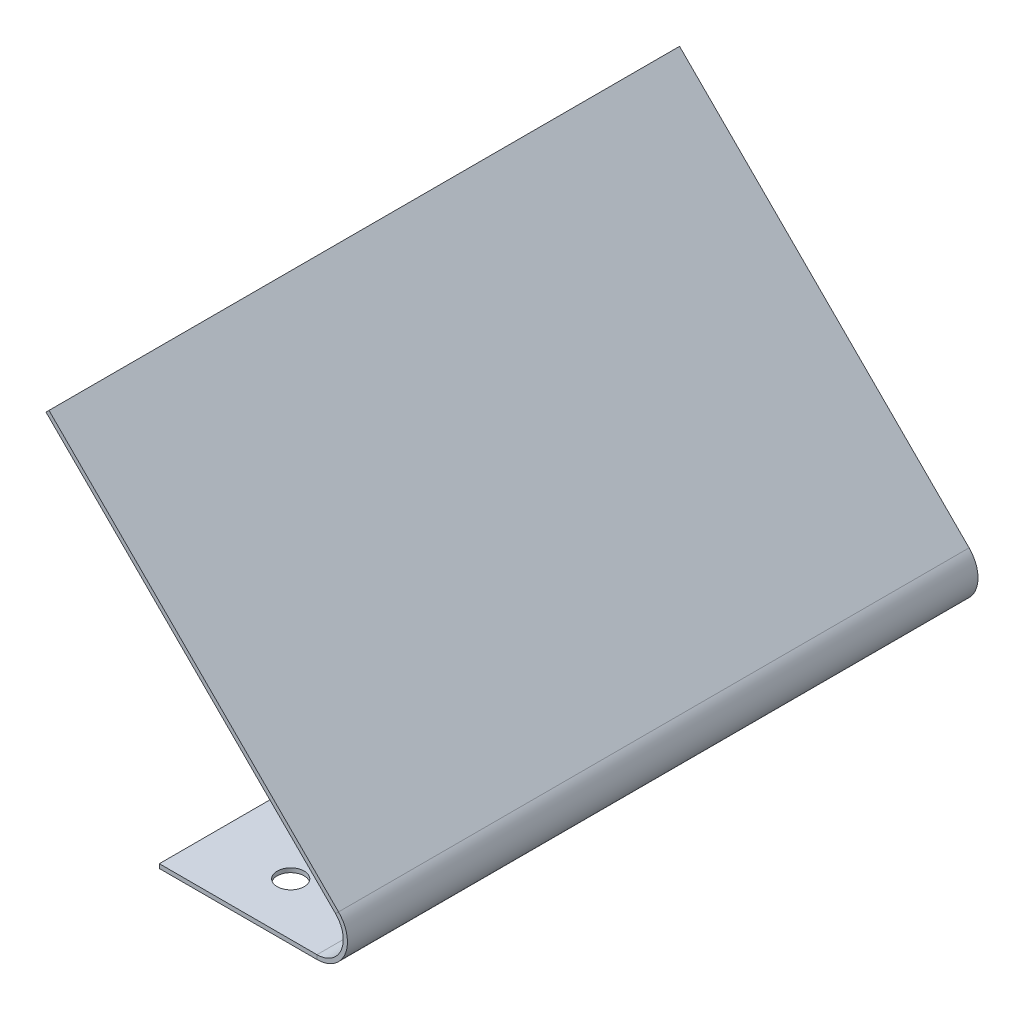
ISO-10303-21;
HEADER;
FILE_DESCRIPTION(('STEP AP214'),'2;1');
FILE_NAME('part.step','',(''),(''),'','','');
FILE_SCHEMA(('AUTOMOTIVE_DESIGN { 1 0 10303 214 1 1 1 1 }'));
ENDSEC;
DATA;
#1=APPLICATION_CONTEXT('core data for automotive mechanical design processes');
#2=APPLICATION_PROTOCOL_DEFINITION('international standard','automotive_design',2000,#1);
#3=PRODUCT_CONTEXT('',#1,'mechanical');
#4=PRODUCT('Part','Part','',(#3));
#5=PRODUCT_RELATED_PRODUCT_CATEGORY('part','',(#4));
#6=PRODUCT_DEFINITION_FORMATION('','',#4);
#7=PRODUCT_DEFINITION_CONTEXT('part definition',#1,'design');
#8=PRODUCT_DEFINITION('design','',#6,#7);
#9=PRODUCT_DEFINITION_SHAPE('','',#8);
#10=(LENGTH_UNIT() NAMED_UNIT(*) SI_UNIT(.MILLI.,.METRE.));
#11=(NAMED_UNIT(*) PLANE_ANGLE_UNIT() SI_UNIT($,.RADIAN.));
#12=(NAMED_UNIT(*) SI_UNIT($,.STERADIAN.) SOLID_ANGLE_UNIT());
#13=UNCERTAINTY_MEASURE_WITH_UNIT(LENGTH_MEASURE(1.E-05),#10,'distance_accuracy_value','');
#14=(GEOMETRIC_REPRESENTATION_CONTEXT(3) GLOBAL_UNCERTAINTY_ASSIGNED_CONTEXT((#13)) GLOBAL_UNIT_ASSIGNED_CONTEXT((#10,
#11,#12)) REPRESENTATION_CONTEXT('',''));
#15=CARTESIAN_POINT('',(0.,0.,0.));
#16=DIRECTION('',(0.,0.,1.));
#17=DIRECTION('',(1.,0.,0.));
#18=AXIS2_PLACEMENT_3D('',#15,#16,#17);
#19=CARTESIAN_POINT('',(-19.05,0.508,0.));
#20=DIRECTION('',(-1.,0.,0.));
#21=DIRECTION('',(0.,0.,1.));
#22=AXIS2_PLACEMENT_3D('',#19,#20,#21);
#23=PLANE('',#22);
#24=DIRECTION('',(0.,1.,0.));
#25=VECTOR('',#24,1.);
#26=CARTESIAN_POINT('',(-19.05,0.508,-76.2));
#27=LINE('',#26,#25);
#28=CARTESIAN_POINT('',(-19.05,0.,-76.2));
#29=VERTEX_POINT('',#28);
#30=CARTESIAN_POINT('',(-19.05,0.508,-76.2));
#31=VERTEX_POINT('',#30);
#32=EDGE_CURVE('E15',#29,#31,#27,.T.);
#33=ORIENTED_EDGE('',*,*,#32,.F.);
#34=DIRECTION('',(0.,0.,1.));
#35=VECTOR('',#34,1.);
#36=CARTESIAN_POINT('',(-19.05,0.,0.));
#37=LINE('',#36,#35);
#38=CARTESIAN_POINT('',(-19.05,0.,0.));
#39=VERTEX_POINT('',#38);
#40=EDGE_CURVE('E146',#29,#39,#37,.T.);
#41=ORIENTED_EDGE('',*,*,#40,.T.);
#42=DIRECTION('',(0.,1.,0.));
#43=VECTOR('',#42,1.);
#44=CARTESIAN_POINT('',(-19.05,0.508,0.));
#45=LINE('',#44,#43);
#46=CARTESIAN_POINT('',(-19.05,0.508,0.));
#47=VERTEX_POINT('',#46);
#48=EDGE_CURVE('E78',#39,#47,#45,.T.);
#49=ORIENTED_EDGE('',*,*,#48,.T.);
#50=DIRECTION('',(0.,0.,1.));
#51=VECTOR('',#50,1.);
#52=CARTESIAN_POINT('',(-19.05,0.508,0.));
#53=LINE('',#52,#51);
#54=EDGE_CURVE('E131',#31,#47,#53,.T.);
#55=ORIENTED_EDGE('',*,*,#54,.F.);
#56=EDGE_LOOP('',(#33,#41,#49,#55));
#57=FACE_BOUND('',#56,.T.);
#58=ADVANCED_FACE('F68',(#57),#23,.T.);
#59=CARTESIAN_POINT('',(0.,0.508,0.));
#60=DIRECTION('',(0.,0.,1.));
#61=DIRECTION('',(1.,0.,0.));
#62=AXIS2_PLACEMENT_3D('',#59,#60,#61);
#63=PLANE('',#62);
#64=ORIENTED_EDGE('',*,*,#48,.F.);
#65=DIRECTION('',(1.,0.,0.));
#66=VECTOR('',#65,1.);
#67=CARTESIAN_POINT('',(0.,0.,0.));
#68=LINE('',#67,#66);
#69=CARTESIAN_POINT('',(0.,0.,0.));
#70=VERTEX_POINT('',#69);
#71=EDGE_CURVE('E144',#39,#70,#68,.T.);
#72=ORIENTED_EDGE('',*,*,#71,.T.);
#73=DIRECTION('',(0.,1.,0.));
#74=VECTOR('',#73,1.);
#75=CARTESIAN_POINT('',(0.,0.508,0.));
#76=LINE('',#75,#74);
#77=CARTESIAN_POINT('',(0.,0.508,0.));
#78=VERTEX_POINT('',#77);
#79=EDGE_CURVE('E86',#70,#78,#76,.T.);
#80=ORIENTED_EDGE('',*,*,#79,.T.);
#81=DIRECTION('',(1.,0.,0.));
#82=VECTOR('',#81,1.);
#83=CARTESIAN_POINT('',(0.,0.508,0.));
#84=LINE('',#83,#82);
#85=EDGE_CURVE('E135',#47,#78,#84,.T.);
#86=ORIENTED_EDGE('',*,*,#85,.F.);
#87=EDGE_LOOP('',(#64,#72,#80,#86));
#88=FACE_BOUND('',#87,.T.);
#89=ADVANCED_FACE('F230',(#88),#63,.T.);
#90=CARTESIAN_POINT('',(0.,0.508,-76.2));
#91=DIRECTION('',(0.,0.,-1.));
#92=DIRECTION('',(-1.,0.,0.));
#93=AXIS2_PLACEMENT_3D('',#90,#91,#92);
#94=PLANE('',#93);
#95=DIRECTION('',(1.,0.,0.));
#96=VECTOR('',#95,1.);
#97=CARTESIAN_POINT('',(0.,0.,-76.2));
#98=LINE('',#97,#96);
#99=CARTESIAN_POINT('',(0.,0.,-76.2));
#100=VERTEX_POINT('',#99);
#101=EDGE_CURVE('E109',#100,#29,#98,.F.);
#102=ORIENTED_EDGE('',*,*,#101,.T.);
#103=ORIENTED_EDGE('',*,*,#32,.T.);
#104=DIRECTION('',(-1.,0.,0.));
#105=VECTOR('',#104,1.);
#106=CARTESIAN_POINT('',(0.,0.508,-76.2));
#107=LINE('',#106,#105);
#108=CARTESIAN_POINT('',(0.,0.508,-76.2));
#109=VERTEX_POINT('',#108);
#110=EDGE_CURVE('E126',#109,#31,#107,.T.);
#111=ORIENTED_EDGE('',*,*,#110,.F.);
#112=DIRECTION('',(0.,1.,0.));
#113=VECTOR('',#112,1.);
#114=CARTESIAN_POINT('',(0.,0.508,-76.2));
#115=LINE('',#114,#113);
#116=EDGE_CURVE('E72',#100,#109,#115,.T.);
#117=ORIENTED_EDGE('',*,*,#116,.F.);
#118=EDGE_LOOP('',(#102,#103,#111,#117));
#119=FACE_BOUND('',#118,.T.);
#120=ADVANCED_FACE('F70',(#119),#94,.T.);
#121=CARTESIAN_POINT('',(0.,0.508,0.));
#122=DIRECTION('',(0.,1.,0.));
#123=DIRECTION('',(0.,0.,1.));
#124=AXIS2_PLACEMENT_3D('',#121,#122,#123);
#125=PLANE('',#124);
#126=CARTESIAN_POINT('',(-9.52499999999999,0.508,-69.85));
#127=DIRECTION('',(0.,1.,0.));
#128=DIRECTION('',(0.,0.,1.));
#129=AXIS2_PLACEMENT_3D('',#126,#127,#128);
#130=CIRCLE('',#129,1.63195);
#131=CARTESIAN_POINT('',(-9.52499999999999,0.508,-68.21805));
#132=VERTEX_POINT('',#131);
#133=EDGE_CURVE('E211',#132,#132,#130,.T.);
#134=ORIENTED_EDGE('',*,*,#133,.F.);
#135=EDGE_LOOP('',(#134));
#136=FACE_BOUND('',#135,.T.);
#137=CARTESIAN_POINT('',(-9.525,0.508,-6.35));
#138=DIRECTION('',(0.,1.,0.));
#139=DIRECTION('',(0.,0.,1.));
#140=AXIS2_PLACEMENT_3D('',#137,#138,#139);
#141=CIRCLE('',#140,1.63195);
#142=CARTESIAN_POINT('',(-9.525,0.508,-4.71805));
#143=VERTEX_POINT('',#142);
#144=EDGE_CURVE('E180',#143,#143,#141,.T.);
#145=ORIENTED_EDGE('',*,*,#144,.F.);
#146=EDGE_LOOP('',(#145));
#147=FACE_BOUND('',#146,.T.);
#148=DIRECTION('',(0.,0.,-1.));
#149=VECTOR('',#148,1.);
#150=CARTESIAN_POINT('',(0.,0.508,0.));
#151=LINE('',#150,#149);
#152=EDGE_CURVE('E133',#78,#109,#151,.T.);
#153=ORIENTED_EDGE('',*,*,#152,.T.);
#154=ORIENTED_EDGE('',*,*,#110,.T.);
#155=ORIENTED_EDGE('',*,*,#54,.T.);
#156=ORIENTED_EDGE('',*,*,#85,.T.);
#157=EDGE_LOOP('',(#153,#154,#155,#156));
#158=FACE_BOUND('',#157,.T.);
#159=ADVANCED_FACE('F130',(#136,#147,#158),#125,.T.);
#160=CARTESIAN_POINT('',(0.,0.,0.));
#161=DIRECTION('',(0.,1.,0.));
#162=DIRECTION('',(0.,0.,1.));
#163=AXIS2_PLACEMENT_3D('',#160,#161,#162);
#164=PLANE('',#163);
#165=CARTESIAN_POINT('',(-9.52499999999999,0.,-69.85));
#166=DIRECTION('',(0.,-1.,0.));
#167=DIRECTION('',(0.,0.,-1.));
#168=AXIS2_PLACEMENT_3D('',#165,#166,#167);
#169=CIRCLE('',#168,1.63194999999999);
#170=CARTESIAN_POINT('',(-9.52499999999999,0.,-71.48195));
#171=VERTEX_POINT('',#170);
#172=EDGE_CURVE('E214',#171,#171,#169,.T.);
#173=ORIENTED_EDGE('',*,*,#172,.F.);
#174=EDGE_LOOP('',(#173));
#175=FACE_BOUND('',#174,.T.);
#176=CARTESIAN_POINT('',(-9.525,0.,-6.35));
#177=DIRECTION('',(0.,-1.,0.));
#178=DIRECTION('',(0.,0.,-1.));
#179=AXIS2_PLACEMENT_3D('',#176,#177,#178);
#180=CIRCLE('',#179,1.63194999999999);
#181=CARTESIAN_POINT('',(-9.525,0.,-7.98194999999999));
#182=VERTEX_POINT('',#181);
#183=EDGE_CURVE('E208',#182,#182,#180,.T.);
#184=ORIENTED_EDGE('',*,*,#183,.F.);
#185=EDGE_LOOP('',(#184));
#186=FACE_BOUND('',#185,.T.);
#187=DIRECTION('',(0.,0.,1.));
#188=VECTOR('',#187,1.);
#189=CARTESIAN_POINT('',(0.,0.,0.));
#190=LINE('',#189,#188);
#191=EDGE_CURVE('E140',#70,#100,#190,.F.);
#192=ORIENTED_EDGE('',*,*,#191,.F.);
#193=ORIENTED_EDGE('',*,*,#71,.F.);
#194=ORIENTED_EDGE('',*,*,#40,.F.);
#195=ORIENTED_EDGE('',*,*,#101,.F.);
#196=EDGE_LOOP('',(#192,#193,#194,#195));
#197=FACE_BOUND('',#196,.T.);
#198=ADVANCED_FACE('F221',(#175,#186,#197),#164,.F.);
#199=CARTESIAN_POINT('',(0.,3.683,0.));
#200=DIRECTION('',(0.,0.,1.));
#201=DIRECTION('',(0.,-1.,0.));
#202=AXIS2_PLACEMENT_3D('',#199,#200,#201);
#203=PLANE('',#202);
#204=DIRECTION('',(-0.707106781186549,-0.707106781186546,0.));
#205=VECTOR('',#204,1.);
#206=CARTESIAN_POINT('',(2.60427427511006,6.28727427511005,0.));
#207=LINE('',#206,#205);
#208=CARTESIAN_POINT('',(2.24506403026729,5.92806403026729,0.));
#209=VERTEX_POINT('',#208);
#210=CARTESIAN_POINT('',(2.60427427511006,6.28727427511005,0.));
#211=VERTEX_POINT('',#210);
#212=EDGE_CURVE('E177',#209,#211,#207,.F.);
#213=ORIENTED_EDGE('',*,*,#212,.F.);
#214=CARTESIAN_POINT('',(0.,3.683,0.));
#215=DIRECTION('',(0.,0.,-1.));
#216=DIRECTION('',(0.,1.,0.));
#217=AXIS2_PLACEMENT_3D('',#214,#215,#216);
#218=CIRCLE('',#217,3.175);
#219=EDGE_CURVE('E166',#78,#209,#218,.F.);
#220=ORIENTED_EDGE('',*,*,#219,.F.);
#221=ORIENTED_EDGE('',*,*,#79,.F.);
#222=CARTESIAN_POINT('',(0.,3.683,0.));
#223=DIRECTION('',(0.,0.,-1.));
#224=DIRECTION('',(0.,1.,0.));
#225=AXIS2_PLACEMENT_3D('',#222,#223,#224);
#226=CIRCLE('',#225,3.683);
#227=EDGE_CURVE('E143',#70,#211,#226,.F.);
#228=ORIENTED_EDGE('',*,*,#227,.T.);
#229=EDGE_LOOP('',(#213,#220,#221,#228));
#230=FACE_BOUND('',#229,.T.);
#231=ADVANCED_FACE('F224',(#230),#203,.T.);
#232=CARTESIAN_POINT('',(0.,3.68299999999999,-76.2));
#233=DIRECTION('',(0.,0.,1.));
#234=DIRECTION('',(0.,-1.,0.));
#235=AXIS2_PLACEMENT_3D('',#232,#233,#234);
#236=PLANE('',#235);
#237=CARTESIAN_POINT('',(0.,3.68299999999999,-76.2));
#238=DIRECTION('',(0.,0.,-1.));
#239=DIRECTION('',(0.,1.,0.));
#240=AXIS2_PLACEMENT_3D('',#237,#238,#239);
#241=CIRCLE('',#240,3.175);
#242=CARTESIAN_POINT('',(2.24506403026729,5.92806403026727,-76.2));
#243=VERTEX_POINT('',#242);
#244=EDGE_CURVE('E156',#243,#109,#241,.T.);
#245=ORIENTED_EDGE('',*,*,#244,.F.);
#246=DIRECTION('',(-0.707106781186549,-0.707106781186546,0.));
#247=VECTOR('',#246,1.);
#248=CARTESIAN_POINT('',(2.2450640302673,5.92806403026728,-76.2));
#249=LINE('',#248,#247);
#250=CARTESIAN_POINT('',(2.60427427511006,6.28727427511005,-76.2));
#251=VERTEX_POINT('',#250);
#252=EDGE_CURVE('E182',#243,#251,#249,.F.);
#253=ORIENTED_EDGE('',*,*,#252,.T.);
#254=CARTESIAN_POINT('',(0.,3.68299999999999,-76.2));
#255=DIRECTION('',(0.,0.,-1.));
#256=DIRECTION('',(0.,1.,0.));
#257=AXIS2_PLACEMENT_3D('',#254,#255,#256);
#258=CIRCLE('',#257,3.683);
#259=EDGE_CURVE('E159',#251,#100,#258,.T.);
#260=ORIENTED_EDGE('',*,*,#259,.T.);
#261=ORIENTED_EDGE('',*,*,#116,.T.);
#262=EDGE_LOOP('',(#245,#253,#260,#261));
#263=FACE_BOUND('',#262,.T.);
#264=ADVANCED_FACE('F154',(#263),#236,.F.);
#265=CARTESIAN_POINT('',(0.,3.68299999999999,-76.2));
#266=DIRECTION('',(0.,0.,-1.));
#267=DIRECTION('',(0.707106781186549,0.707106781186546,0.));
#268=AXIS2_PLACEMENT_3D('',#265,#266,#267);
#269=CYLINDRICAL_SURFACE('',#268,3.683);
#270=ORIENTED_EDGE('',*,*,#191,.T.);
#271=ORIENTED_EDGE('',*,*,#259,.F.);
#272=DIRECTION('',(0.,0.,-1.));
#273=VECTOR('',#272,1.);
#274=CARTESIAN_POINT('',(2.60427427511006,6.28727427511005,0.));
#275=LINE('',#274,#273);
#276=EDGE_CURVE('E184',#251,#211,#275,.F.);
#277=ORIENTED_EDGE('',*,*,#276,.T.);
#278=ORIENTED_EDGE('',*,*,#227,.F.);
#279=EDGE_LOOP('',(#270,#271,#277,#278));
#280=FACE_BOUND('',#279,.T.);
#281=ADVANCED_FACE('F232',(#280),#269,.T.);
#282=CARTESIAN_POINT('',(0.,3.68299999999999,-76.2));
#283=DIRECTION('',(0.,0.,-1.));
#284=DIRECTION('',(0.707106781186549,0.707106781186546,0.));
#285=AXIS2_PLACEMENT_3D('',#282,#283,#284);
#286=CYLINDRICAL_SURFACE('',#285,3.175);
#287=ORIENTED_EDGE('',*,*,#152,.F.);
#288=ORIENTED_EDGE('',*,*,#219,.T.);
#289=DIRECTION('',(0.,0.,-1.));
#290=VECTOR('',#289,1.);
#291=CARTESIAN_POINT('',(2.24506403026729,5.92806403026729,0.));
#292=LINE('',#291,#290);
#293=EDGE_CURVE('E165',#209,#243,#292,.T.);
#294=ORIENTED_EDGE('',*,*,#293,.T.);
#295=ORIENTED_EDGE('',*,*,#244,.T.);
#296=EDGE_LOOP('',(#287,#288,#294,#295));
#297=FACE_BOUND('',#296,.T.);
#298=ADVANCED_FACE('F161',(#297),#286,.F.);
#299=CARTESIAN_POINT('',(-32.3868142394338,41.278362789654,-76.2));
#300=DIRECTION('',(0.,0.,1.));
#301=DIRECTION('',(1.,0.,0.));
#302=AXIS2_PLACEMENT_3D('',#299,#300,#301);
#303=PLANE('',#302);
#304=ORIENTED_EDGE('',*,*,#252,.F.);
#305=DIRECTION('',(0.707106781186546,-0.707106781186549,0.));
#306=VECTOR('',#305,1.);
#307=CARTESIAN_POINT('',(-32.7460244842766,40.9191525448113,-76.2));
#308=LINE('',#307,#306);
#309=CARTESIAN_POINT('',(-32.7460244842766,40.9191525448113,-76.2));
#310=VERTEX_POINT('',#309);
#311=EDGE_CURVE('E186',#243,#310,#308,.F.);
#312=ORIENTED_EDGE('',*,*,#311,.T.);
#313=DIRECTION('',(-0.707106781186549,-0.707106781186546,0.));
#314=VECTOR('',#313,1.);
#315=CARTESIAN_POINT('',(-32.3868142394338,41.278362789654,-76.2));
#316=LINE('',#315,#314);
#317=CARTESIAN_POINT('',(-32.3868142394338,41.278362789654,-76.2));
#318=VERTEX_POINT('',#317);
#319=EDGE_CURVE('E167',#318,#310,#316,.T.);
#320=ORIENTED_EDGE('',*,*,#319,.F.);
#321=DIRECTION('',(-0.707106781186546,0.707106781186549,0.));
#322=VECTOR('',#321,1.);
#323=CARTESIAN_POINT('',(8.27833830537732,0.613210244842766,-76.2));
#324=LINE('',#323,#322);
#325=EDGE_CURVE('E195',#251,#318,#324,.T.);
#326=ORIENTED_EDGE('',*,*,#325,.F.);
#327=EDGE_LOOP('',(#304,#312,#320,#326));
#328=FACE_BOUND('',#327,.T.);
#329=ADVANCED_FACE('F243',(#328),#303,.F.);
#330=CARTESIAN_POINT('',(8.02433830537733,0.867210244842766,0.));
#331=DIRECTION('',(0.,0.,-1.));
#332=DIRECTION('',(-1.,0.,0.));
#333=AXIS2_PLACEMENT_3D('',#330,#331,#332);
#334=PLANE('',#333);
#335=ORIENTED_EDGE('',*,*,#212,.T.);
#336=DIRECTION('',(0.707106781186546,-0.707106781186549,0.));
#337=VECTOR('',#336,1.);
#338=CARTESIAN_POINT('',(8.27833830537732,0.613210244842766,0.));
#339=LINE('',#338,#337);
#340=CARTESIAN_POINT('',(-32.3868142394338,41.278362789654,0.));
#341=VERTEX_POINT('',#340);
#342=EDGE_CURVE('E201',#341,#211,#339,.T.);
#343=ORIENTED_EDGE('',*,*,#342,.F.);
#344=DIRECTION('',(-0.707106781186549,-0.707106781186546,0.));
#345=VECTOR('',#344,1.);
#346=CARTESIAN_POINT('',(-32.3868142394338,41.278362789654,0.));
#347=LINE('',#346,#345);
#348=CARTESIAN_POINT('',(-32.7460244842766,40.9191525448113,0.));
#349=VERTEX_POINT('',#348);
#350=EDGE_CURVE('E171',#341,#349,#347,.T.);
#351=ORIENTED_EDGE('',*,*,#350,.T.);
#352=DIRECTION('',(-0.707106781186546,0.707106781186549,0.));
#353=VECTOR('',#352,1.);
#354=CARTESIAN_POINT('',(7.66512806053456,0.508000000000001,0.));
#355=LINE('',#354,#353);
#356=EDGE_CURVE('E192',#349,#209,#355,.F.);
#357=ORIENTED_EDGE('',*,*,#356,.T.);
#358=EDGE_LOOP('',(#335,#343,#351,#357));
#359=FACE_BOUND('',#358,.T.);
#360=ADVANCED_FACE('F258',(#359),#334,.F.);
#361=CARTESIAN_POINT('',(8.27833830537732,0.613210244842766,0.));
#362=DIRECTION('',(-0.707106781186549,-0.707106781186546,0.));
#363=DIRECTION('',(0.707106781186546,-0.707106781186549,0.));
#364=AXIS2_PLACEMENT_3D('',#361,#362,#363);
#365=PLANE('',#364);
#366=ORIENTED_EDGE('',*,*,#276,.F.);
#367=ORIENTED_EDGE('',*,*,#325,.T.);
#368=DIRECTION('',(0.,0.,1.));
#369=VECTOR('',#368,1.);
#370=CARTESIAN_POINT('',(-32.3868142394338,41.278362789654,0.));
#371=LINE('',#370,#369);
#372=EDGE_CURVE('E198',#318,#341,#371,.T.);
#373=ORIENTED_EDGE('',*,*,#372,.T.);
#374=ORIENTED_EDGE('',*,*,#342,.T.);
#375=EDGE_LOOP('',(#366,#367,#373,#374));
#376=FACE_BOUND('',#375,.T.);
#377=ADVANCED_FACE('F237',(#376),#365,.F.);
#378=CARTESIAN_POINT('',(7.91912806053456,0.254,0.));
#379=DIRECTION('',(-0.707106781186549,-0.707106781186546,0.));
#380=DIRECTION('',(0.707106781186546,-0.707106781186549,0.));
#381=AXIS2_PLACEMENT_3D('',#378,#379,#380);
#382=PLANE('',#381);
#383=ORIENTED_EDGE('',*,*,#311,.F.);
#384=ORIENTED_EDGE('',*,*,#293,.F.);
#385=ORIENTED_EDGE('',*,*,#356,.F.);
#386=DIRECTION('',(0.,0.,-1.));
#387=VECTOR('',#386,1.);
#388=CARTESIAN_POINT('',(-32.7460244842766,40.9191525448113,0.));
#389=LINE('',#388,#387);
#390=EDGE_CURVE('E189',#310,#349,#389,.F.);
#391=ORIENTED_EDGE('',*,*,#390,.F.);
#392=EDGE_LOOP('',(#383,#384,#385,#391));
#393=FACE_BOUND('',#392,.T.);
#394=ADVANCED_FACE('F259',(#393),#382,.T.);
#395=CARTESIAN_POINT('',(-32.3868142394338,41.278362789654,0.));
#396=DIRECTION('',(0.707106781186546,-0.707106781186549,0.));
#397=DIRECTION('',(0.707106781186549,0.707106781186546,0.));
#398=AXIS2_PLACEMENT_3D('',#395,#396,#397);
#399=PLANE('',#398);
#400=ORIENTED_EDGE('',*,*,#390,.T.);
#401=ORIENTED_EDGE('',*,*,#350,.F.);
#402=ORIENTED_EDGE('',*,*,#372,.F.);
#403=ORIENTED_EDGE('',*,*,#319,.T.);
#404=EDGE_LOOP('',(#400,#401,#402,#403));
#405=FACE_BOUND('',#404,.T.);
#406=ADVANCED_FACE('F251',(#405),#399,.F.);
#407=CARTESIAN_POINT('',(-9.525,0.,-6.35));
#408=DIRECTION('',(0.,-1.,0.));
#409=DIRECTION('',(0.,0.,-1.));
#410=AXIS2_PLACEMENT_3D('',#407,#408,#409);
#411=CYLINDRICAL_SURFACE('',#410,1.63195);
#412=ORIENTED_EDGE('',*,*,#183,.T.);
#413=EDGE_LOOP('',(#412));
#414=FACE_BOUND('',#413,.T.);
#415=ORIENTED_EDGE('',*,*,#144,.T.);
#416=EDGE_LOOP('',(#415));
#417=FACE_BOUND('',#416,.T.);
#418=ADVANCED_FACE('F266',(#414,#417),#411,.F.);
#419=CARTESIAN_POINT('',(-9.52499999999999,0.,-69.85));
#420=DIRECTION('',(0.,-1.,0.));
#421=DIRECTION('',(0.,0.,-1.));
#422=AXIS2_PLACEMENT_3D('',#419,#420,#421);
#423=CYLINDRICAL_SURFACE('',#422,1.63195);
#424=ORIENTED_EDGE('',*,*,#172,.T.);
#425=EDGE_LOOP('',(#424));
#426=FACE_BOUND('',#425,.T.);
#427=ORIENTED_EDGE('',*,*,#133,.T.);
#428=EDGE_LOOP('',(#427));
#429=FACE_BOUND('',#428,.T.);
#430=ADVANCED_FACE('F218',(#426,#429),#423,.F.);
#431=CLOSED_SHELL('',(#58,#89,#120,#159,#198,#231,#264,#281,#298,#329,#360,#377,#394,#406,#418,#430));
#432=MANIFOLD_SOLID_BREP('B2',#431);
#433=ADVANCED_BREP_SHAPE_REPRESENTATION('',(#18,#432),#14);
#434=SHAPE_DEFINITION_REPRESENTATION(#9,#433);
ENDSEC;
END-ISO-10303-21;
